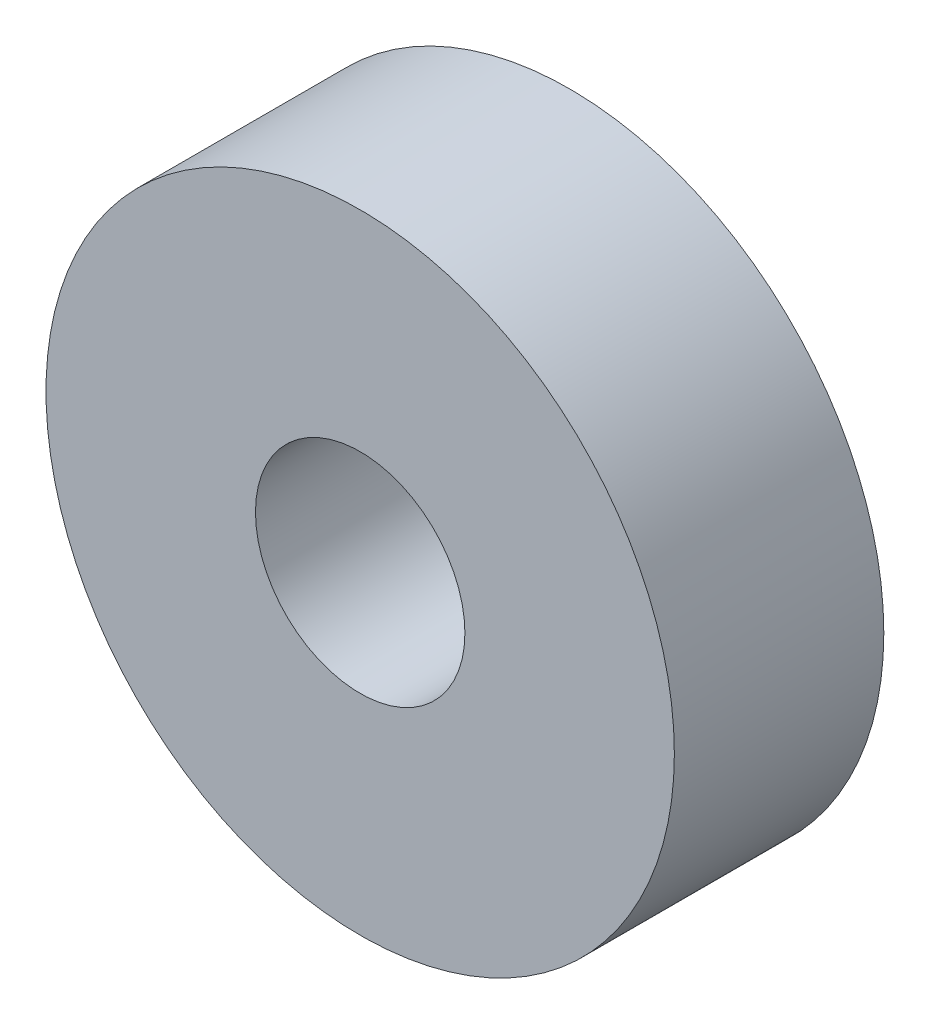
ISO-10303-21;
HEADER;
FILE_DESCRIPTION(('STEP AP214'),'2;1');
FILE_NAME('part.step','',(''),(''),'','','');
FILE_SCHEMA(('AUTOMOTIVE_DESIGN { 1 0 10303 214 1 1 1 1 }'));
ENDSEC;
DATA;
#1=APPLICATION_CONTEXT('core data for automotive mechanical design processes');
#2=APPLICATION_PROTOCOL_DEFINITION('international standard','automotive_design',2000,#1);
#3=PRODUCT_CONTEXT('',#1,'mechanical');
#4=PRODUCT('Part','Part','',(#3));
#5=PRODUCT_RELATED_PRODUCT_CATEGORY('part','',(#4));
#6=PRODUCT_DEFINITION_FORMATION('','',#4);
#7=PRODUCT_DEFINITION_CONTEXT('part definition',#1,'design');
#8=PRODUCT_DEFINITION('design','',#6,#7);
#9=PRODUCT_DEFINITION_SHAPE('','',#8);
#10=(LENGTH_UNIT() NAMED_UNIT(*) SI_UNIT(.MILLI.,.METRE.));
#11=(NAMED_UNIT(*) PLANE_ANGLE_UNIT() SI_UNIT($,.RADIAN.));
#12=(NAMED_UNIT(*) SI_UNIT($,.STERADIAN.) SOLID_ANGLE_UNIT());
#13=UNCERTAINTY_MEASURE_WITH_UNIT(LENGTH_MEASURE(1.E-05),#10,'distance_accuracy_value','');
#14=(GEOMETRIC_REPRESENTATION_CONTEXT(3) GLOBAL_UNCERTAINTY_ASSIGNED_CONTEXT((#13)) GLOBAL_UNIT_ASSIGNED_CONTEXT((#10,
#11,#12)) REPRESENTATION_CONTEXT('',''));
#15=CARTESIAN_POINT('',(0.,0.,0.));
#16=DIRECTION('',(0.,0.,1.));
#17=DIRECTION('',(1.,0.,0.));
#18=AXIS2_PLACEMENT_3D('',#15,#16,#17);
#19=CARTESIAN_POINT('',(0.,0.,4.));
#20=DIRECTION('',(0.,0.,1.));
#21=DIRECTION('',(1.,0.,0.));
#22=AXIS2_PLACEMENT_3D('',#19,#20,#21);
#23=PLANE('',#22);
#24=CARTESIAN_POINT('',(0.,0.,4.));
#25=DIRECTION('',(0.,0.,1.));
#26=DIRECTION('',(1.,0.,0.));
#27=AXIS2_PLACEMENT_3D('',#24,#25,#26);
#28=CIRCLE('',#27,6.);
#29=CARTESIAN_POINT('',(6.,0.,4.));
#30=VERTEX_POINT('',#29);
#31=EDGE_CURVE('E10',#30,#30,#28,.T.);
#32=ORIENTED_EDGE('',*,*,#31,.T.);
#33=EDGE_LOOP('',(#32));
#34=FACE_BOUND('',#33,.T.);
#35=CARTESIAN_POINT('',(0.,0.,4.));
#36=DIRECTION('',(0.,0.,1.));
#37=DIRECTION('',(1.,0.,0.));
#38=AXIS2_PLACEMENT_3D('',#35,#36,#37);
#39=CIRCLE('',#38,2.);
#40=CARTESIAN_POINT('',(2.,0.,4.));
#41=VERTEX_POINT('',#40);
#42=EDGE_CURVE('E46',#41,#41,#39,.T.);
#43=ORIENTED_EDGE('',*,*,#42,.F.);
#44=EDGE_LOOP('',(#43));
#45=FACE_BOUND('',#44,.T.);
#46=ADVANCED_FACE('F35',(#34,#45),#23,.T.);
#47=CARTESIAN_POINT('',(0.,0.,0.));
#48=DIRECTION('',(0.,0.,1.));
#49=DIRECTION('',(1.,0.,0.));
#50=AXIS2_PLACEMENT_3D('',#47,#48,#49);
#51=PLANE('',#50);
#52=CARTESIAN_POINT('',(0.,0.,0.));
#53=DIRECTION('',(0.,0.,1.));
#54=DIRECTION('',(1.,0.,0.));
#55=AXIS2_PLACEMENT_3D('',#52,#53,#54);
#56=CIRCLE('',#55,6.);
#57=CARTESIAN_POINT('',(6.,0.,0.));
#58=VERTEX_POINT('',#57);
#59=EDGE_CURVE('E39',#58,#58,#56,.T.);
#60=ORIENTED_EDGE('',*,*,#59,.F.);
#61=EDGE_LOOP('',(#60));
#62=FACE_BOUND('',#61,.T.);
#63=CARTESIAN_POINT('',(0.,0.,0.));
#64=DIRECTION('',(0.,0.,1.));
#65=DIRECTION('',(1.,0.,0.));
#66=AXIS2_PLACEMENT_3D('',#63,#64,#65);
#67=CIRCLE('',#66,2.);
#68=CARTESIAN_POINT('',(2.,0.,0.));
#69=VERTEX_POINT('',#68);
#70=EDGE_CURVE('E48',#69,#69,#67,.T.);
#71=ORIENTED_EDGE('',*,*,#70,.T.);
#72=EDGE_LOOP('',(#71));
#73=FACE_BOUND('',#72,.T.);
#74=ADVANCED_FACE('F58',(#62,#73),#51,.F.);
#75=CARTESIAN_POINT('',(0.,0.,4.));
#76=DIRECTION('',(0.,0.,-1.));
#77=DIRECTION('',(-1.,0.,0.));
#78=AXIS2_PLACEMENT_3D('',#75,#76,#77);
#79=CYLINDRICAL_SURFACE('',#78,6.);
#80=ORIENTED_EDGE('',*,*,#31,.F.);
#81=EDGE_LOOP('',(#80));
#82=FACE_BOUND('',#81,.T.);
#83=ORIENTED_EDGE('',*,*,#59,.T.);
#84=EDGE_LOOP('',(#83));
#85=FACE_BOUND('',#84,.T.);
#86=ADVANCED_FACE('F37',(#82,#85),#79,.T.);
#87=CARTESIAN_POINT('',(0.,0.,4.));
#88=DIRECTION('',(0.,0.,-1.));
#89=DIRECTION('',(-1.,0.,0.));
#90=AXIS2_PLACEMENT_3D('',#87,#88,#89);
#91=CYLINDRICAL_SURFACE('',#90,2.);
#92=ORIENTED_EDGE('',*,*,#42,.T.);
#93=EDGE_LOOP('',(#92));
#94=FACE_BOUND('',#93,.T.);
#95=ORIENTED_EDGE('',*,*,#70,.F.);
#96=EDGE_LOOP('',(#95));
#97=FACE_BOUND('',#96,.T.);
#98=ADVANCED_FACE('F54',(#94,#97),#91,.F.);
#99=CLOSED_SHELL('',(#46,#74,#86,#98));
#100=MANIFOLD_SOLID_BREP('B2',#99);
#101=ADVANCED_BREP_SHAPE_REPRESENTATION('',(#18,#100),#14);
#102=SHAPE_DEFINITION_REPRESENTATION(#9,#101);
ENDSEC;
END-ISO-10303-21;
